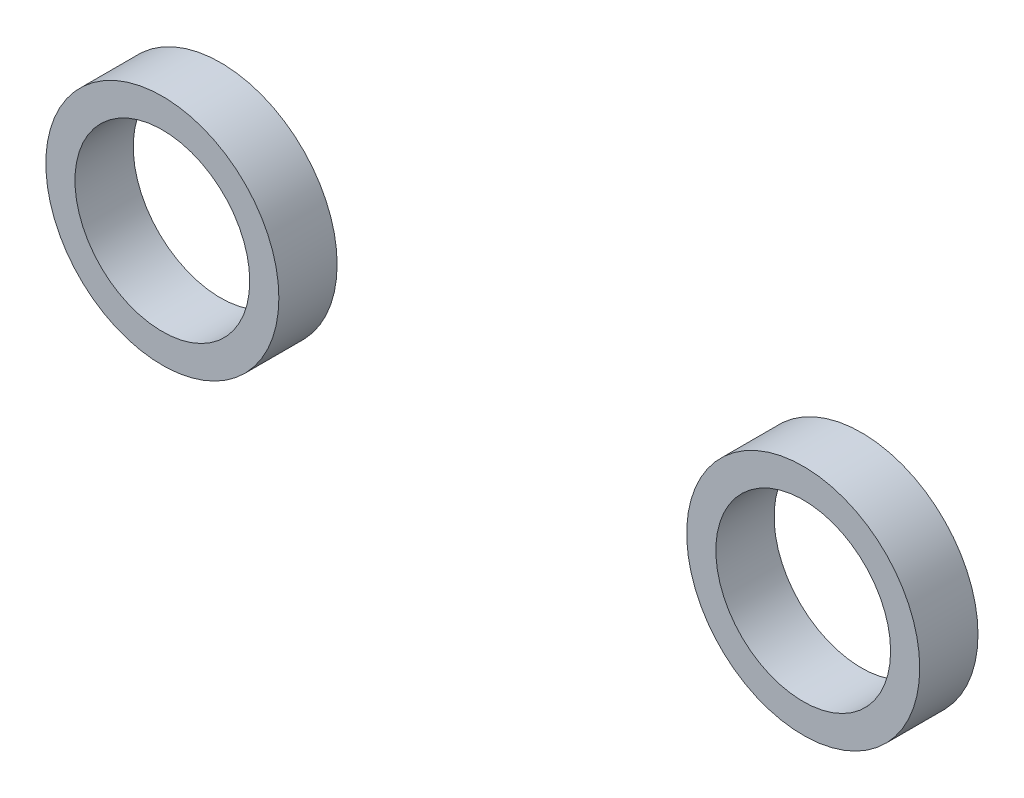
ISO-10303-21;
HEADER;
FILE_DESCRIPTION(('STEP AP214'),'2;1');
FILE_NAME('part.step','',(''),(''),'','','');
FILE_SCHEMA(('AUTOMOTIVE_DESIGN { 1 0 10303 214 1 1 1 1 }'));
ENDSEC;
DATA;
#1=APPLICATION_CONTEXT('core data for automotive mechanical design processes');
#2=APPLICATION_PROTOCOL_DEFINITION('international standard','automotive_design',2000,#1);
#3=PRODUCT_CONTEXT('',#1,'mechanical');
#4=PRODUCT('Part','Part','',(#3));
#5=PRODUCT_RELATED_PRODUCT_CATEGORY('part','',(#4));
#6=PRODUCT_DEFINITION_FORMATION('','',#4);
#7=PRODUCT_DEFINITION_CONTEXT('part definition',#1,'design');
#8=PRODUCT_DEFINITION('design','',#6,#7);
#9=PRODUCT_DEFINITION_SHAPE('','',#8);
#10=(LENGTH_UNIT() NAMED_UNIT(*) SI_UNIT(.MILLI.,.METRE.));
#11=(NAMED_UNIT(*) PLANE_ANGLE_UNIT() SI_UNIT($,.RADIAN.));
#12=(NAMED_UNIT(*) SI_UNIT($,.STERADIAN.) SOLID_ANGLE_UNIT());
#13=UNCERTAINTY_MEASURE_WITH_UNIT(LENGTH_MEASURE(1.E-05),#10,'distance_accuracy_value','');
#14=(GEOMETRIC_REPRESENTATION_CONTEXT(3) GLOBAL_UNCERTAINTY_ASSIGNED_CONTEXT((#13)) GLOBAL_UNIT_ASSIGNED_CONTEXT((#10,
#11,#12)) REPRESENTATION_CONTEXT('',''));
#15=CARTESIAN_POINT('',(0.,0.,0.));
#16=DIRECTION('',(0.,0.,1.));
#17=DIRECTION('',(1.,0.,0.));
#18=AXIS2_PLACEMENT_3D('',#15,#16,#17);
#19=CARTESIAN_POINT('',(47.2573684210527,165.1,1.27));
#20=DIRECTION('',(0.,0.,1.));
#21=DIRECTION('',(1.,0.,0.));
#22=AXIS2_PLACEMENT_3D('',#19,#20,#21);
#23=PLANE('',#22);
#24=CARTESIAN_POINT('',(47.2573684210527,165.1,1.27));
#25=DIRECTION('',(0.,0.,1.));
#26=DIRECTION('',(1.,0.,0.));
#27=AXIS2_PLACEMENT_3D('',#24,#25,#26);
#28=CIRCLE('',#27,2.54000000000001);
#29=CARTESIAN_POINT('',(49.7973684210527,165.1,1.27));
#30=VERTEX_POINT('',#29);
#31=EDGE_CURVE('E12',#30,#30,#28,.T.);
#32=ORIENTED_EDGE('',*,*,#31,.T.);
#33=EDGE_LOOP('',(#32));
#34=FACE_BOUND('',#33,.T.);
#35=CARTESIAN_POINT('',(47.2573684210527,165.1,1.27));
#36=DIRECTION('',(0.,0.,1.));
#37=DIRECTION('',(1.,0.,0.));
#38=AXIS2_PLACEMENT_3D('',#35,#36,#37);
#39=CIRCLE('',#38,1.905);
#40=CARTESIAN_POINT('',(49.1623684210527,165.1,1.27));
#41=VERTEX_POINT('',#40);
#42=EDGE_CURVE('E54',#41,#41,#39,.T.);
#43=ORIENTED_EDGE('',*,*,#42,.F.);
#44=EDGE_LOOP('',(#43));
#45=FACE_BOUND('',#44,.T.);
#46=ADVANCED_FACE('F42',(#34,#45),#23,.T.);
#47=CARTESIAN_POINT('',(47.2573684210527,165.1,0.));
#48=DIRECTION('',(0.,0.,1.));
#49=DIRECTION('',(1.,0.,0.));
#50=AXIS2_PLACEMENT_3D('',#47,#48,#49);
#51=PLANE('',#50);
#52=CARTESIAN_POINT('',(47.2573684210527,165.1,0.));
#53=DIRECTION('',(0.,0.,1.));
#54=DIRECTION('',(1.,0.,0.));
#55=AXIS2_PLACEMENT_3D('',#52,#53,#54);
#56=CIRCLE('',#55,2.54000000000001);
#57=CARTESIAN_POINT('',(49.7973684210527,165.1,0.));
#58=VERTEX_POINT('',#57);
#59=EDGE_CURVE('E46',#58,#58,#56,.T.);
#60=ORIENTED_EDGE('',*,*,#59,.F.);
#61=EDGE_LOOP('',(#60));
#62=FACE_BOUND('',#61,.T.);
#63=CARTESIAN_POINT('',(47.2573684210527,165.1,0.));
#64=DIRECTION('',(0.,0.,1.));
#65=DIRECTION('',(1.,0.,0.));
#66=AXIS2_PLACEMENT_3D('',#63,#64,#65);
#67=CIRCLE('',#66,1.905);
#68=CARTESIAN_POINT('',(49.1623684210527,165.1,0.));
#69=VERTEX_POINT('',#68);
#70=EDGE_CURVE('E56',#69,#69,#67,.T.);
#71=ORIENTED_EDGE('',*,*,#70,.T.);
#72=EDGE_LOOP('',(#71));
#73=FACE_BOUND('',#72,.T.);
#74=ADVANCED_FACE('F68',(#62,#73),#51,.F.);
#75=CARTESIAN_POINT('',(47.2573684210527,165.1,1.27));
#76=DIRECTION('',(0.,0.,-1.));
#77=DIRECTION('',(-1.,0.,0.));
#78=AXIS2_PLACEMENT_3D('',#75,#76,#77);
#79=CYLINDRICAL_SURFACE('',#78,2.54000000000001);
#80=ORIENTED_EDGE('',*,*,#31,.F.);
#81=EDGE_LOOP('',(#80));
#82=FACE_BOUND('',#81,.T.);
#83=ORIENTED_EDGE('',*,*,#59,.T.);
#84=EDGE_LOOP('',(#83));
#85=FACE_BOUND('',#84,.T.);
#86=ADVANCED_FACE('F44',(#82,#85),#79,.T.);
#87=CARTESIAN_POINT('',(47.2573684210527,165.1,1.27));
#88=DIRECTION('',(0.,0.,-1.));
#89=DIRECTION('',(-1.,0.,0.));
#90=AXIS2_PLACEMENT_3D('',#87,#88,#89);
#91=CYLINDRICAL_SURFACE('',#90,1.905);
#92=ORIENTED_EDGE('',*,*,#42,.T.);
#93=EDGE_LOOP('',(#92));
#94=FACE_BOUND('',#93,.T.);
#95=ORIENTED_EDGE('',*,*,#70,.F.);
#96=EDGE_LOOP('',(#95));
#97=FACE_BOUND('',#96,.T.);
#98=ADVANCED_FACE('F70',(#94,#97),#91,.F.);
#99=CLOSED_SHELL('',(#46,#74,#86,#98));
#100=MANIFOLD_SOLID_BREP('B2',#99);
#101=CARTESIAN_POINT('',(33.2873684210527,165.1,1.27));
#102=DIRECTION('',(0.,0.,1.));
#103=DIRECTION('',(1.,0.,0.));
#104=AXIS2_PLACEMENT_3D('',#101,#102,#103);
#105=PLANE('',#104);
#106=CARTESIAN_POINT('',(33.2873684210527,165.1,1.27));
#107=DIRECTION('',(0.,0.,1.));
#108=DIRECTION('',(1.,0.,0.));
#109=AXIS2_PLACEMENT_3D('',#106,#107,#108);
#110=CIRCLE('',#109,2.54000000000001);
#111=CARTESIAN_POINT('',(35.8273684210527,165.1,1.27));
#112=VERTEX_POINT('',#111);
#113=EDGE_CURVE('E41',#112,#112,#110,.T.);
#114=ORIENTED_EDGE('',*,*,#113,.T.);
#115=EDGE_LOOP('',(#114));
#116=FACE_BOUND('',#115,.T.);
#117=CARTESIAN_POINT('',(33.2873684210527,165.1,1.27));
#118=DIRECTION('',(0.,0.,1.));
#119=DIRECTION('',(1.,0.,0.));
#120=AXIS2_PLACEMENT_3D('',#117,#118,#119);
#121=CIRCLE('',#120,1.905);
#122=CARTESIAN_POINT('',(35.1923684210527,165.1,1.27));
#123=VERTEX_POINT('',#122);
#124=EDGE_CURVE('E122',#123,#123,#121,.T.);
#125=ORIENTED_EDGE('',*,*,#124,.F.);
#126=EDGE_LOOP('',(#125));
#127=FACE_BOUND('',#126,.T.);
#128=ADVANCED_FACE('F110',(#116,#127),#105,.T.);
#129=CARTESIAN_POINT('',(33.2873684210527,165.1,0.));
#130=DIRECTION('',(0.,0.,1.));
#131=DIRECTION('',(1.,0.,0.));
#132=AXIS2_PLACEMENT_3D('',#129,#130,#131);
#133=PLANE('',#132);
#134=CARTESIAN_POINT('',(33.2873684210527,165.1,0.));
#135=DIRECTION('',(0.,0.,1.));
#136=DIRECTION('',(1.,0.,0.));
#137=AXIS2_PLACEMENT_3D('',#134,#135,#136);
#138=CIRCLE('',#137,2.54000000000001);
#139=CARTESIAN_POINT('',(35.8273684210527,165.1,0.));
#140=VERTEX_POINT('',#139);
#141=EDGE_CURVE('E114',#140,#140,#138,.T.);
#142=ORIENTED_EDGE('',*,*,#141,.F.);
#143=EDGE_LOOP('',(#142));
#144=FACE_BOUND('',#143,.T.);
#145=CARTESIAN_POINT('',(33.2873684210527,165.1,0.));
#146=DIRECTION('',(0.,0.,1.));
#147=DIRECTION('',(1.,0.,0.));
#148=AXIS2_PLACEMENT_3D('',#145,#146,#147);
#149=CIRCLE('',#148,1.905);
#150=CARTESIAN_POINT('',(35.1923684210527,165.1,0.));
#151=VERTEX_POINT('',#150);
#152=EDGE_CURVE('E124',#151,#151,#149,.T.);
#153=ORIENTED_EDGE('',*,*,#152,.T.);
#154=EDGE_LOOP('',(#153));
#155=FACE_BOUND('',#154,.T.);
#156=ADVANCED_FACE('F136',(#144,#155),#133,.F.);
#157=CARTESIAN_POINT('',(33.2873684210527,165.1,1.27));
#158=DIRECTION('',(0.,0.,-1.));
#159=DIRECTION('',(-1.,0.,0.));
#160=AXIS2_PLACEMENT_3D('',#157,#158,#159);
#161=CYLINDRICAL_SURFACE('',#160,2.54000000000001);
#162=ORIENTED_EDGE('',*,*,#113,.F.);
#163=EDGE_LOOP('',(#162));
#164=FACE_BOUND('',#163,.T.);
#165=ORIENTED_EDGE('',*,*,#141,.T.);
#166=EDGE_LOOP('',(#165));
#167=FACE_BOUND('',#166,.T.);
#168=ADVANCED_FACE('F112',(#164,#167),#161,.T.);
#169=CARTESIAN_POINT('',(33.2873684210527,165.1,1.27));
#170=DIRECTION('',(0.,0.,-1.));
#171=DIRECTION('',(-1.,0.,0.));
#172=AXIS2_PLACEMENT_3D('',#169,#170,#171);
#173=CYLINDRICAL_SURFACE('',#172,1.905);
#174=ORIENTED_EDGE('',*,*,#124,.T.);
#175=EDGE_LOOP('',(#174));
#176=FACE_BOUND('',#175,.T.);
#177=ORIENTED_EDGE('',*,*,#152,.F.);
#178=EDGE_LOOP('',(#177));
#179=FACE_BOUND('',#178,.T.);
#180=ADVANCED_FACE('F138',(#176,#179),#173,.F.);
#181=CLOSED_SHELL('',(#128,#156,#168,#180));
#182=MANIFOLD_SOLID_BREP('B7',#181);
#183=ADVANCED_BREP_SHAPE_REPRESENTATION('',(#18,#100,#182),#14);
#184=SHAPE_DEFINITION_REPRESENTATION(#9,#183);
ENDSEC;
END-ISO-10303-21;
